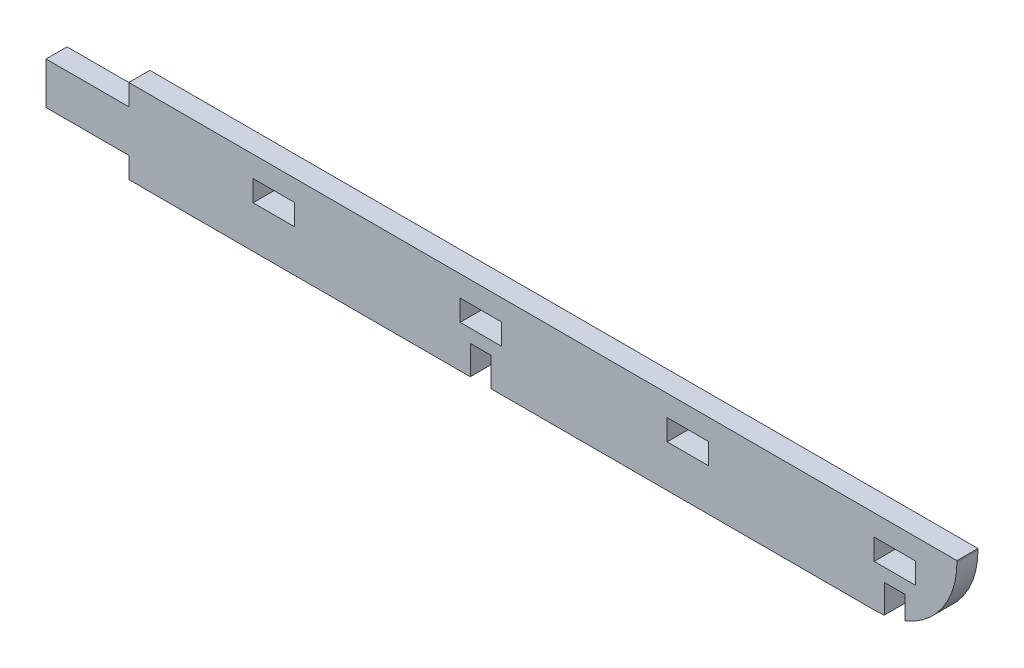
ISO-10303-21;
HEADER;
FILE_DESCRIPTION(('STEP AP214'),'2;1');
FILE_NAME('part.step','',(''),(''),'','','');
FILE_SCHEMA(('AUTOMOTIVE_DESIGN { 1 0 10303 214 1 1 1 1 }'));
ENDSEC;
DATA;
#1=APPLICATION_CONTEXT('core data for automotive mechanical design processes');
#2=APPLICATION_PROTOCOL_DEFINITION('international standard','automotive_design',2000,#1);
#3=PRODUCT_CONTEXT('',#1,'mechanical');
#4=PRODUCT('Part','Part','',(#3));
#5=PRODUCT_RELATED_PRODUCT_CATEGORY('part','',(#4));
#6=PRODUCT_DEFINITION_FORMATION('','',#4);
#7=PRODUCT_DEFINITION_CONTEXT('part definition',#1,'design');
#8=PRODUCT_DEFINITION('design','',#6,#7);
#9=PRODUCT_DEFINITION_SHAPE('','',#8);
#10=(LENGTH_UNIT() NAMED_UNIT(*) SI_UNIT(.MILLI.,.METRE.));
#11=(NAMED_UNIT(*) PLANE_ANGLE_UNIT() SI_UNIT($,.RADIAN.));
#12=(NAMED_UNIT(*) SI_UNIT($,.STERADIAN.) SOLID_ANGLE_UNIT());
#13=UNCERTAINTY_MEASURE_WITH_UNIT(LENGTH_MEASURE(1.E-05),#10,'distance_accuracy_value','');
#14=(GEOMETRIC_REPRESENTATION_CONTEXT(3) GLOBAL_UNCERTAINTY_ASSIGNED_CONTEXT((#13)) GLOBAL_UNIT_ASSIGNED_CONTEXT((#10,
#11,#12)) REPRESENTATION_CONTEXT('',''));
#15=CARTESIAN_POINT('',(0.,0.,0.));
#16=DIRECTION('',(0.,0.,1.));
#17=DIRECTION('',(1.,0.,0.));
#18=AXIS2_PLACEMENT_3D('',#15,#16,#17);
#19=CARTESIAN_POINT('',(80.,9.84,5.08));
#20=DIRECTION('',(0.,0.,-1.));
#21=DIRECTION('',(-1.,0.,0.));
#22=AXIS2_PLACEMENT_3D('',#19,#20,#21);
#23=CYLINDRICAL_SURFACE('',#22,20.);
#24=DIRECTION('',(0.,0.,-1.));
#25=VECTOR('',#24,1.);
#26=CARTESIAN_POINT('',(82.46,-10.0081334134976,5.08));
#27=LINE('',#26,#25);
#28=CARTESIAN_POINT('',(82.46,-10.0081334134976,5.08));
#29=VERTEX_POINT('',#28);
#30=CARTESIAN_POINT('',(82.46,-10.0081334134976,0.));
#31=VERTEX_POINT('',#30);
#32=EDGE_CURVE('E11',#29,#31,#27,.T.);
#33=ORIENTED_EDGE('',*,*,#32,.F.);
#34=CARTESIAN_POINT('',(80.,9.84,5.08));
#35=DIRECTION('',(0.,0.,-1.));
#36=DIRECTION('',(-1.,0.,0.));
#37=AXIS2_PLACEMENT_3D('',#34,#35,#36);
#38=CIRCLE('',#37,20.);
#39=CARTESIAN_POINT('',(80.,-10.16,5.08));
#40=VERTEX_POINT('',#39);
#41=EDGE_CURVE('E494',#40,#29,#38,.F.);
#42=ORIENTED_EDGE('',*,*,#41,.F.);
#43=DIRECTION('',(0.,0.,-1.));
#44=VECTOR('',#43,1.);
#45=CARTESIAN_POINT('',(80.,-10.16,5.08));
#46=LINE('',#45,#44);
#47=CARTESIAN_POINT('',(80.,-10.16,0.));
#48=VERTEX_POINT('',#47);
#49=EDGE_CURVE('E490',#48,#40,#46,.F.);
#50=ORIENTED_EDGE('',*,*,#49,.F.);
#51=CARTESIAN_POINT('',(80.,9.84,0.));
#52=DIRECTION('',(0.,0.,-1.));
#53=DIRECTION('',(-1.,0.,0.));
#54=AXIS2_PLACEMENT_3D('',#51,#52,#53);
#55=CIRCLE('',#54,20.);
#56=EDGE_CURVE('E486',#31,#48,#55,.T.);
#57=ORIENTED_EDGE('',*,*,#56,.F.);
#58=EDGE_LOOP('',(#33,#42,#50,#57));
#59=FACE_BOUND('',#58,.T.);
#60=ADVANCED_FACE('F33',(#59),#23,.T.);
#61=CARTESIAN_POINT('',(-100.,-10.16,5.08));
#62=DIRECTION('',(0.,1.,0.));
#63=DIRECTION('',(0.,0.,1.));
#64=AXIS2_PLACEMENT_3D('',#61,#62,#63);
#65=PLANE('',#64);
#66=DIRECTION('',(1.,0.,0.));
#67=VECTOR('',#66,1.);
#68=CARTESIAN_POINT('',(-100.,-10.16,0.));
#69=LINE('',#68,#67);
#70=CARTESIAN_POINT('',(-100.,-10.16,0.));
#71=VERTEX_POINT('',#70);
#72=CARTESIAN_POINT('',(-17.54,-10.16,0.));
#73=VERTEX_POINT('',#72);
#74=EDGE_CURVE('E430',#71,#73,#69,.T.);
#75=ORIENTED_EDGE('',*,*,#74,.T.);
#76=DIRECTION('',(0.,0.,1.));
#77=VECTOR('',#76,1.);
#78=CARTESIAN_POINT('',(-17.54,-10.16,0.));
#79=LINE('',#78,#77);
#80=CARTESIAN_POINT('',(-17.54,-10.16,5.08));
#81=VERTEX_POINT('',#80);
#82=EDGE_CURVE('E411',#73,#81,#79,.T.);
#83=ORIENTED_EDGE('',*,*,#82,.T.);
#84=DIRECTION('',(1.,0.,0.));
#85=VECTOR('',#84,1.);
#86=CARTESIAN_POINT('',(-100.,-10.16,5.08));
#87=LINE('',#86,#85);
#88=CARTESIAN_POINT('',(-100.,-10.16,5.08));
#89=VERTEX_POINT('',#88);
#90=EDGE_CURVE('E443',#89,#81,#87,.T.);
#91=ORIENTED_EDGE('',*,*,#90,.F.);
#92=DIRECTION('',(0.,0.,-1.));
#93=VECTOR('',#92,1.);
#94=CARTESIAN_POINT('',(-100.,-10.16,5.08));
#95=LINE('',#94,#93);
#96=EDGE_CURVE('E446',#89,#71,#95,.T.);
#97=ORIENTED_EDGE('',*,*,#96,.T.);
#98=EDGE_LOOP('',(#75,#83,#91,#97));
#99=FACE_BOUND('',#98,.T.);
#100=ADVANCED_FACE('F546',(#99),#65,.F.);
#101=CARTESIAN_POINT('',(100.,-10.16,5.08));
#102=DIRECTION('',(-1.,0.,0.));
#103=DIRECTION('',(0.,0.,1.));
#104=AXIS2_PLACEMENT_3D('',#101,#102,#103);
#105=PLANE('',#104);
#106=DIRECTION('',(0.,1.,0.));
#107=VECTOR('',#106,1.);
#108=CARTESIAN_POINT('',(100.,-10.16,5.08));
#109=LINE('',#108,#107);
#110=CARTESIAN_POINT('',(100.,9.84,5.08));
#111=VERTEX_POINT('',#110);
#112=CARTESIAN_POINT('',(100.,10.16,5.08));
#113=VERTEX_POINT('',#112);
#114=EDGE_CURVE('E427',#111,#113,#109,.T.);
#115=ORIENTED_EDGE('',*,*,#114,.F.);
#116=DIRECTION('',(0.,0.,-1.));
#117=VECTOR('',#116,1.);
#118=CARTESIAN_POINT('',(100.,9.84,5.08));
#119=LINE('',#118,#117);
#120=CARTESIAN_POINT('',(100.,9.84,0.));
#121=VERTEX_POINT('',#120);
#122=EDGE_CURVE('E483',#111,#121,#119,.T.);
#123=ORIENTED_EDGE('',*,*,#122,.T.);
#124=DIRECTION('',(0.,1.,0.));
#125=VECTOR('',#124,1.);
#126=CARTESIAN_POINT('',(100.,-10.16,0.));
#127=LINE('',#126,#125);
#128=CARTESIAN_POINT('',(100.,10.16,0.));
#129=VERTEX_POINT('',#128);
#130=EDGE_CURVE('E420',#121,#129,#127,.T.);
#131=ORIENTED_EDGE('',*,*,#130,.T.);
#132=DIRECTION('',(0.,0.,-1.));
#133=VECTOR('',#132,1.);
#134=CARTESIAN_POINT('',(100.,10.16,5.08));
#135=LINE('',#134,#133);
#136=EDGE_CURVE('E480',#113,#129,#135,.T.);
#137=ORIENTED_EDGE('',*,*,#136,.F.);
#138=EDGE_LOOP('',(#115,#123,#131,#137));
#139=FACE_BOUND('',#138,.T.);
#140=ADVANCED_FACE('F510',(#139),#105,.F.);
#141=CARTESIAN_POINT('',(-100.,10.16,5.08));
#142=DIRECTION('',(0.,-1.,0.));
#143=DIRECTION('',(0.,0.,-1.));
#144=AXIS2_PLACEMENT_3D('',#141,#142,#143);
#145=PLANE('',#144);
#146=DIRECTION('',(-1.,0.,0.));
#147=VECTOR('',#146,1.);
#148=CARTESIAN_POINT('',(-100.,10.16,0.));
#149=LINE('',#148,#147);
#150=CARTESIAN_POINT('',(-100.,10.16,0.));
#151=VERTEX_POINT('',#150);
#152=EDGE_CURVE('E448',#129,#151,#149,.T.);
#153=ORIENTED_EDGE('',*,*,#152,.T.);
#154=DIRECTION('',(0.,0.,-1.));
#155=VECTOR('',#154,1.);
#156=CARTESIAN_POINT('',(-100.,10.16,5.08));
#157=LINE('',#156,#155);
#158=CARTESIAN_POINT('',(-100.,10.16,5.08));
#159=VERTEX_POINT('',#158);
#160=EDGE_CURVE('E477',#159,#151,#157,.T.);
#161=ORIENTED_EDGE('',*,*,#160,.F.);
#162=DIRECTION('',(-1.,0.,0.));
#163=VECTOR('',#162,1.);
#164=CARTESIAN_POINT('',(-100.,10.16,5.08));
#165=LINE('',#164,#163);
#166=EDGE_CURVE('E429',#113,#159,#165,.T.);
#167=ORIENTED_EDGE('',*,*,#166,.F.);
#168=ORIENTED_EDGE('',*,*,#136,.T.);
#169=EDGE_LOOP('',(#153,#161,#167,#168));
#170=FACE_BOUND('',#169,.T.);
#171=ADVANCED_FACE('F519',(#170),#145,.F.);
#172=CARTESIAN_POINT('',(-100.,5.08,5.08));
#173=DIRECTION('',(1.,0.,0.));
#174=DIRECTION('',(0.,0.,-1.));
#175=AXIS2_PLACEMENT_3D('',#172,#173,#174);
#176=PLANE('',#175);
#177=DIRECTION('',(0.,-1.,0.));
#178=VECTOR('',#177,1.);
#179=CARTESIAN_POINT('',(-100.,5.08,0.));
#180=LINE('',#179,#178);
#181=CARTESIAN_POINT('',(-100.,5.08,0.));
#182=VERTEX_POINT('',#181);
#183=EDGE_CURVE('E450',#151,#182,#180,.T.);
#184=ORIENTED_EDGE('',*,*,#183,.T.);
#185=DIRECTION('',(0.,0.,-1.));
#186=VECTOR('',#185,1.);
#187=CARTESIAN_POINT('',(-100.,5.08,5.08));
#188=LINE('',#187,#186);
#189=CARTESIAN_POINT('',(-100.,5.08,5.08));
#190=VERTEX_POINT('',#189);
#191=EDGE_CURVE('E474',#190,#182,#188,.T.);
#192=ORIENTED_EDGE('',*,*,#191,.F.);
#193=DIRECTION('',(0.,-1.,0.));
#194=VECTOR('',#193,1.);
#195=CARTESIAN_POINT('',(-100.,5.08,5.08));
#196=LINE('',#195,#194);
#197=EDGE_CURVE('E432',#159,#190,#196,.T.);
#198=ORIENTED_EDGE('',*,*,#197,.F.);
#199=ORIENTED_EDGE('',*,*,#160,.T.);
#200=EDGE_LOOP('',(#184,#192,#198,#199));
#201=FACE_BOUND('',#200,.T.);
#202=ADVANCED_FACE('F525',(#201),#176,.F.);
#203=CARTESIAN_POINT('',(-100.,5.08,5.08));
#204=DIRECTION('',(0.,-1.,0.));
#205=DIRECTION('',(1.,0.,0.));
#206=AXIS2_PLACEMENT_3D('',#203,#204,#205);
#207=PLANE('',#206);
#208=DIRECTION('',(-1.,0.,0.));
#209=VECTOR('',#208,1.);
#210=CARTESIAN_POINT('',(-100.,5.08,0.));
#211=LINE('',#210,#209);
#212=CARTESIAN_POINT('',(-120.,5.08,0.));
#213=VERTEX_POINT('',#212);
#214=EDGE_CURVE('E452',#182,#213,#211,.T.);
#215=ORIENTED_EDGE('',*,*,#214,.T.);
#216=DIRECTION('',(0.,0.,-1.));
#217=VECTOR('',#216,1.);
#218=CARTESIAN_POINT('',(-120.,5.08,5.08));
#219=LINE('',#218,#217);
#220=CARTESIAN_POINT('',(-120.,5.08,5.08));
#221=VERTEX_POINT('',#220);
#222=EDGE_CURVE('E471',#221,#213,#219,.T.);
#223=ORIENTED_EDGE('',*,*,#222,.F.);
#224=DIRECTION('',(-1.,0.,0.));
#225=VECTOR('',#224,1.);
#226=CARTESIAN_POINT('',(-100.,5.08,5.08));
#227=LINE('',#226,#225);
#228=EDGE_CURVE('E434',#190,#221,#227,.T.);
#229=ORIENTED_EDGE('',*,*,#228,.F.);
#230=ORIENTED_EDGE('',*,*,#191,.T.);
#231=EDGE_LOOP('',(#215,#223,#229,#230));
#232=FACE_BOUND('',#231,.T.);
#233=ADVANCED_FACE('F527',(#232),#207,.F.);
#234=CARTESIAN_POINT('',(-120.,5.08,5.08));
#235=DIRECTION('',(1.,0.,0.));
#236=DIRECTION('',(0.,0.,-1.));
#237=AXIS2_PLACEMENT_3D('',#234,#235,#236);
#238=PLANE('',#237);
#239=DIRECTION('',(0.,-1.,0.));
#240=VECTOR('',#239,1.);
#241=CARTESIAN_POINT('',(-120.,5.08,0.));
#242=LINE('',#241,#240);
#243=CARTESIAN_POINT('',(-120.,-5.08,0.));
#244=VERTEX_POINT('',#243);
#245=EDGE_CURVE('E454',#213,#244,#242,.T.);
#246=ORIENTED_EDGE('',*,*,#245,.T.);
#247=DIRECTION('',(0.,0.,-1.));
#248=VECTOR('',#247,1.);
#249=CARTESIAN_POINT('',(-120.,-5.08,5.08));
#250=LINE('',#249,#248);
#251=CARTESIAN_POINT('',(-120.,-5.08,5.08));
#252=VERTEX_POINT('',#251);
#253=EDGE_CURVE('E468',#252,#244,#250,.T.);
#254=ORIENTED_EDGE('',*,*,#253,.F.);
#255=DIRECTION('',(0.,-1.,0.));
#256=VECTOR('',#255,1.);
#257=CARTESIAN_POINT('',(-120.,5.08,5.08));
#258=LINE('',#257,#256);
#259=EDGE_CURVE('E436',#221,#252,#258,.T.);
#260=ORIENTED_EDGE('',*,*,#259,.F.);
#261=ORIENTED_EDGE('',*,*,#222,.T.);
#262=EDGE_LOOP('',(#246,#254,#260,#261));
#263=FACE_BOUND('',#262,.T.);
#264=ADVANCED_FACE('F532',(#263),#238,.F.);
#265=CARTESIAN_POINT('',(-100.,-5.08,5.08));
#266=DIRECTION('',(0.,1.,0.));
#267=DIRECTION('',(-1.,0.,0.));
#268=AXIS2_PLACEMENT_3D('',#265,#266,#267);
#269=PLANE('',#268);
#270=DIRECTION('',(1.,0.,0.));
#271=VECTOR('',#270,1.);
#272=CARTESIAN_POINT('',(-100.,-5.08,0.));
#273=LINE('',#272,#271);
#274=CARTESIAN_POINT('',(-100.,-5.08,0.));
#275=VERTEX_POINT('',#274);
#276=EDGE_CURVE('E456',#244,#275,#273,.T.);
#277=ORIENTED_EDGE('',*,*,#276,.T.);
#278=DIRECTION('',(0.,0.,-1.));
#279=VECTOR('',#278,1.);
#280=CARTESIAN_POINT('',(-100.,-5.08,5.08));
#281=LINE('',#280,#279);
#282=CARTESIAN_POINT('',(-100.,-5.08,5.08));
#283=VERTEX_POINT('',#282);
#284=EDGE_CURVE('E465',#283,#275,#281,.T.);
#285=ORIENTED_EDGE('',*,*,#284,.F.);
#286=DIRECTION('',(1.,0.,0.));
#287=VECTOR('',#286,1.);
#288=CARTESIAN_POINT('',(-100.,-5.08,5.08));
#289=LINE('',#288,#287);
#290=EDGE_CURVE('E438',#252,#283,#289,.T.);
#291=ORIENTED_EDGE('',*,*,#290,.F.);
#292=ORIENTED_EDGE('',*,*,#253,.T.);
#293=EDGE_LOOP('',(#277,#285,#291,#292));
#294=FACE_BOUND('',#293,.T.);
#295=ADVANCED_FACE('F538',(#294),#269,.F.);
#296=CARTESIAN_POINT('',(-100.,-10.16,5.08));
#297=DIRECTION('',(1.,0.,0.));
#298=DIRECTION('',(0.,0.,-1.));
#299=AXIS2_PLACEMENT_3D('',#296,#297,#298);
#300=PLANE('',#299);
#301=DIRECTION('',(0.,-1.,0.));
#302=VECTOR('',#301,1.);
#303=CARTESIAN_POINT('',(-100.,-10.16,0.));
#304=LINE('',#303,#302);
#305=EDGE_CURVE('E458',#275,#71,#304,.T.);
#306=ORIENTED_EDGE('',*,*,#305,.T.);
#307=ORIENTED_EDGE('',*,*,#96,.F.);
#308=DIRECTION('',(0.,-1.,0.));
#309=VECTOR('',#308,1.);
#310=CARTESIAN_POINT('',(-100.,-10.16,5.08));
#311=LINE('',#310,#309);
#312=EDGE_CURVE('E440',#283,#89,#311,.T.);
#313=ORIENTED_EDGE('',*,*,#312,.F.);
#314=ORIENTED_EDGE('',*,*,#284,.T.);
#315=EDGE_LOOP('',(#306,#307,#313,#314));
#316=FACE_BOUND('',#315,.T.);
#317=ADVANCED_FACE('F542',(#316),#300,.F.);
#318=CARTESIAN_POINT('',(-12.54,-10.16,5.08));
#319=VERTEX_POINT('',#318);
#320=EDGE_CURVE('E442',#319,#40,#87,.T.);
#321=ORIENTED_EDGE('',*,*,#320,.F.);
#322=DIRECTION('',(0.,0.,1.));
#323=VECTOR('',#322,1.);
#324=CARTESIAN_POINT('',(-12.54,-10.16,0.));
#325=LINE('',#324,#323);
#326=CARTESIAN_POINT('',(-12.54,-10.16,0.));
#327=VERTEX_POINT('',#326);
#328=EDGE_CURVE('E423',#327,#319,#325,.T.);
#329=ORIENTED_EDGE('',*,*,#328,.F.);
#330=EDGE_CURVE('E460',#327,#48,#69,.T.);
#331=ORIENTED_EDGE('',*,*,#330,.T.);
#332=ORIENTED_EDGE('',*,*,#49,.T.);
#333=EDGE_LOOP('',(#321,#329,#331,#332));
#334=FACE_BOUND('',#333,.T.);
#335=ADVANCED_FACE('F561',(#334),#65,.F.);
#336=CARTESIAN_POINT('',(0.,0.,5.08));
#337=DIRECTION('',(0.,0.,-1.));
#338=DIRECTION('',(-1.,0.,0.));
#339=AXIS2_PLACEMENT_3D('',#336,#337,#338);
#340=PLANE('',#339);
#341=DIRECTION('',(1.,0.,0.));
#342=VECTOR('',#341,1.);
#343=CARTESIAN_POINT('',(80.,0.,5.08));
#344=LINE('',#343,#342);
#345=CARTESIAN_POINT('',(80.,0.,5.08));
#346=VERTEX_POINT('',#345);
#347=CARTESIAN_POINT('',(90.,0.,5.08));
#348=VERTEX_POINT('',#347);
#349=EDGE_CURVE('E274',#346,#348,#344,.T.);
#350=ORIENTED_EDGE('',*,*,#349,.F.);
#351=DIRECTION('',(0.,-1.,0.));
#352=VECTOR('',#351,1.);
#353=CARTESIAN_POINT('',(80.,5.08,5.08));
#354=LINE('',#353,#352);
#355=CARTESIAN_POINT('',(80.,5.08,5.08));
#356=VERTEX_POINT('',#355);
#357=EDGE_CURVE('E48',#356,#346,#354,.T.);
#358=ORIENTED_EDGE('',*,*,#357,.F.);
#359=DIRECTION('',(-1.,0.,0.));
#360=VECTOR('',#359,1.);
#361=CARTESIAN_POINT('',(80.,5.08,5.08));
#362=LINE('',#361,#360);
#363=CARTESIAN_POINT('',(90.,5.08,5.08));
#364=VERTEX_POINT('',#363);
#365=EDGE_CURVE('E265',#364,#356,#362,.T.);
#366=ORIENTED_EDGE('',*,*,#365,.F.);
#367=DIRECTION('',(0.,1.,0.));
#368=VECTOR('',#367,1.);
#369=CARTESIAN_POINT('',(90.,5.08,5.08));
#370=LINE('',#369,#368);
#371=EDGE_CURVE('E268',#348,#364,#370,.T.);
#372=ORIENTED_EDGE('',*,*,#371,.F.);
#373=EDGE_LOOP('',(#350,#358,#366,#372));
#374=FACE_BOUND('',#373,.T.);
#375=DIRECTION('',(1.,0.,0.));
#376=VECTOR('',#375,1.);
#377=CARTESIAN_POINT('',(30.,0.,5.08));
#378=LINE('',#377,#376);
#379=CARTESIAN_POINT('',(30.,0.,5.08));
#380=VERTEX_POINT('',#379);
#381=CARTESIAN_POINT('',(40.,0.,5.08));
#382=VERTEX_POINT('',#381);
#383=EDGE_CURVE('E299',#380,#382,#378,.T.);
#384=ORIENTED_EDGE('',*,*,#383,.F.);
#385=DIRECTION('',(0.,-1.,0.));
#386=VECTOR('',#385,1.);
#387=CARTESIAN_POINT('',(30.,5.08,5.08));
#388=LINE('',#387,#386);
#389=CARTESIAN_POINT('',(30.,5.08,5.08));
#390=VERTEX_POINT('',#389);
#391=EDGE_CURVE('E280',#390,#380,#388,.T.);
#392=ORIENTED_EDGE('',*,*,#391,.F.);
#393=DIRECTION('',(-1.,0.,0.));
#394=VECTOR('',#393,1.);
#395=CARTESIAN_POINT('',(30.,5.08,5.08));
#396=LINE('',#395,#394);
#397=CARTESIAN_POINT('',(40.,5.08,5.08));
#398=VERTEX_POINT('',#397);
#399=EDGE_CURVE('E288',#398,#390,#396,.T.);
#400=ORIENTED_EDGE('',*,*,#399,.F.);
#401=DIRECTION('',(0.,1.,0.));
#402=VECTOR('',#401,1.);
#403=CARTESIAN_POINT('',(40.,5.08,5.08));
#404=LINE('',#403,#402);
#405=EDGE_CURVE('E302',#382,#398,#404,.T.);
#406=ORIENTED_EDGE('',*,*,#405,.F.);
#407=EDGE_LOOP('',(#384,#392,#400,#406));
#408=FACE_BOUND('',#407,.T.);
#409=DIRECTION('',(1.,0.,0.));
#410=VECTOR('',#409,1.);
#411=CARTESIAN_POINT('',(-20.,0.,5.08));
#412=LINE('',#411,#410);
#413=CARTESIAN_POINT('',(-20.,0.,5.08));
#414=VERTEX_POINT('',#413);
#415=CARTESIAN_POINT('',(-10.,0.,5.08));
#416=VERTEX_POINT('',#415);
#417=EDGE_CURVE('E331',#414,#416,#412,.T.);
#418=ORIENTED_EDGE('',*,*,#417,.F.);
#419=DIRECTION('',(0.,-1.,0.));
#420=VECTOR('',#419,1.);
#421=CARTESIAN_POINT('',(-20.,5.08,5.08));
#422=LINE('',#421,#420);
#423=CARTESIAN_POINT('',(-20.,5.08,5.08));
#424=VERTEX_POINT('',#423);
#425=EDGE_CURVE('E309',#424,#414,#422,.T.);
#426=ORIENTED_EDGE('',*,*,#425,.F.);
#427=DIRECTION('',(-1.,0.,0.));
#428=VECTOR('',#427,1.);
#429=CARTESIAN_POINT('',(-20.,5.08,5.08));
#430=LINE('',#429,#428);
#431=CARTESIAN_POINT('',(-10.,5.08,5.08));
#432=VERTEX_POINT('',#431);
#433=EDGE_CURVE('E320',#432,#424,#430,.T.);
#434=ORIENTED_EDGE('',*,*,#433,.F.);
#435=DIRECTION('',(0.,1.,0.));
#436=VECTOR('',#435,1.);
#437=CARTESIAN_POINT('',(-10.,5.08,5.08));
#438=LINE('',#437,#436);
#439=EDGE_CURVE('E334',#416,#432,#438,.T.);
#440=ORIENTED_EDGE('',*,*,#439,.F.);
#441=EDGE_LOOP('',(#418,#426,#434,#440));
#442=FACE_BOUND('',#441,.T.);
#443=DIRECTION('',(1.,0.,0.));
#444=VECTOR('',#443,1.);
#445=CARTESIAN_POINT('',(-70.,0.,5.08));
#446=LINE('',#445,#444);
#447=CARTESIAN_POINT('',(-70.,0.,5.08));
#448=VERTEX_POINT('',#447);
#449=CARTESIAN_POINT('',(-60.,0.,5.08));
#450=VERTEX_POINT('',#449);
#451=EDGE_CURVE('E363',#448,#450,#446,.T.);
#452=ORIENTED_EDGE('',*,*,#451,.F.);
#453=DIRECTION('',(0.,-1.,0.));
#454=VECTOR('',#453,1.);
#455=CARTESIAN_POINT('',(-70.,5.08,5.08));
#456=LINE('',#455,#454);
#457=CARTESIAN_POINT('',(-70.,5.08,5.08));
#458=VERTEX_POINT('',#457);
#459=EDGE_CURVE('E341',#458,#448,#456,.T.);
#460=ORIENTED_EDGE('',*,*,#459,.F.);
#461=DIRECTION('',(-1.,0.,0.));
#462=VECTOR('',#461,1.);
#463=CARTESIAN_POINT('',(-70.,5.08,5.08));
#464=LINE('',#463,#462);
#465=CARTESIAN_POINT('',(-60.,5.08,5.08));
#466=VERTEX_POINT('',#465);
#467=EDGE_CURVE('E352',#466,#458,#464,.T.);
#468=ORIENTED_EDGE('',*,*,#467,.F.);
#469=DIRECTION('',(0.,1.,0.));
#470=VECTOR('',#469,1.);
#471=CARTESIAN_POINT('',(-60.,5.08,5.08));
#472=LINE('',#471,#470);
#473=EDGE_CURVE('E366',#450,#466,#472,.T.);
#474=ORIENTED_EDGE('',*,*,#473,.F.);
#475=EDGE_LOOP('',(#452,#460,#468,#474));
#476=FACE_BOUND('',#475,.T.);
#477=ORIENTED_EDGE('',*,*,#41,.T.);
#478=DIRECTION('',(0.,-1.,0.));
#479=VECTOR('',#478,1.);
#480=CARTESIAN_POINT('',(82.46,-10.16,5.08));
#481=LINE('',#480,#479);
#482=CARTESIAN_POINT('',(82.46,-3.16,5.08));
#483=VERTEX_POINT('',#482);
#484=EDGE_CURVE('E373',#483,#29,#481,.T.);
#485=ORIENTED_EDGE('',*,*,#484,.F.);
#486=DIRECTION('',(-1.,0.,0.));
#487=VECTOR('',#486,1.);
#488=CARTESIAN_POINT('',(82.46,-3.16,5.08));
#489=LINE('',#488,#487);
#490=CARTESIAN_POINT('',(87.46,-3.16,5.08));
#491=VERTEX_POINT('',#490);
#492=EDGE_CURVE('E384',#491,#483,#489,.T.);
#493=ORIENTED_EDGE('',*,*,#492,.F.);
#494=DIRECTION('',(0.,1.,0.));
#495=VECTOR('',#494,1.);
#496=CARTESIAN_POINT('',(87.46,-10.16,5.08));
#497=LINE('',#496,#495);
#498=CARTESIAN_POINT('',(87.46,-8.71662684864898,5.08));
#499=VERTEX_POINT('',#498);
#500=EDGE_CURVE('E392',#499,#491,#497,.T.);
#501=ORIENTED_EDGE('',*,*,#500,.F.);
#502=EDGE_CURVE('E493',#499,#111,#38,.F.);
#503=ORIENTED_EDGE('',*,*,#502,.T.);
#504=ORIENTED_EDGE('',*,*,#114,.T.);
#505=ORIENTED_EDGE('',*,*,#166,.T.);
#506=ORIENTED_EDGE('',*,*,#197,.T.);
#507=ORIENTED_EDGE('',*,*,#228,.T.);
#508=ORIENTED_EDGE('',*,*,#259,.T.);
#509=ORIENTED_EDGE('',*,*,#290,.T.);
#510=ORIENTED_EDGE('',*,*,#312,.T.);
#511=ORIENTED_EDGE('',*,*,#90,.T.);
#512=DIRECTION('',(0.,-1.,0.));
#513=VECTOR('',#512,1.);
#514=CARTESIAN_POINT('',(-17.54,-10.16,5.08));
#515=LINE('',#514,#513);
#516=CARTESIAN_POINT('',(-17.54,-3.16,5.08));
#517=VERTEX_POINT('',#516);
#518=EDGE_CURVE('E398',#517,#81,#515,.T.);
#519=ORIENTED_EDGE('',*,*,#518,.F.);
#520=DIRECTION('',(-1.,0.,0.));
#521=VECTOR('',#520,1.);
#522=CARTESIAN_POINT('',(-17.54,-3.16,5.08));
#523=LINE('',#522,#521);
#524=CARTESIAN_POINT('',(-12.54,-3.16,5.08));
#525=VERTEX_POINT('',#524);
#526=EDGE_CURVE('E405',#525,#517,#523,.T.);
#527=ORIENTED_EDGE('',*,*,#526,.F.);
#528=DIRECTION('',(0.,1.,0.));
#529=VECTOR('',#528,1.);
#530=CARTESIAN_POINT('',(-12.54,-10.16,5.08));
#531=LINE('',#530,#529);
#532=EDGE_CURVE('E413',#319,#525,#531,.T.);
#533=ORIENTED_EDGE('',*,*,#532,.F.);
#534=ORIENTED_EDGE('',*,*,#320,.T.);
#535=EDGE_LOOP('',(#477,#485,#493,#501,#503,#504,#505,#506,#507,#508,#509,#510,#511,#519,#527,
#533,#534));
#536=FACE_BOUND('',#535,.T.);
#537=ADVANCED_FACE('F504',(#374,#408,#442,#476,#536),#340,.F.);
#538=CARTESIAN_POINT('',(0.,0.,0.));
#539=DIRECTION('',(0.,0.,-1.));
#540=DIRECTION('',(-1.,0.,0.));
#541=AXIS2_PLACEMENT_3D('',#538,#539,#540);
#542=PLANE('',#541);
#543=DIRECTION('',(0.,-1.,0.));
#544=VECTOR('',#543,1.);
#545=CARTESIAN_POINT('',(80.,5.08,0.));
#546=LINE('',#545,#544);
#547=CARTESIAN_POINT('',(80.,5.08,0.));
#548=VERTEX_POINT('',#547);
#549=CARTESIAN_POINT('',(80.,0.,0.));
#550=VERTEX_POINT('',#549);
#551=EDGE_CURVE('E249',#548,#550,#546,.T.);
#552=ORIENTED_EDGE('',*,*,#551,.T.);
#553=DIRECTION('',(1.,0.,0.));
#554=VECTOR('',#553,1.);
#555=CARTESIAN_POINT('',(80.,0.,0.));
#556=LINE('',#555,#554);
#557=CARTESIAN_POINT('',(90.,0.,0.));
#558=VERTEX_POINT('',#557);
#559=EDGE_CURVE('E258',#550,#558,#556,.T.);
#560=ORIENTED_EDGE('',*,*,#559,.T.);
#561=DIRECTION('',(0.,1.,0.));
#562=VECTOR('',#561,1.);
#563=CARTESIAN_POINT('',(90.,5.08,0.));
#564=LINE('',#563,#562);
#565=CARTESIAN_POINT('',(90.,5.08,0.));
#566=VERTEX_POINT('',#565);
#567=EDGE_CURVE('E56',#558,#566,#564,.T.);
#568=ORIENTED_EDGE('',*,*,#567,.T.);
#569=DIRECTION('',(-1.,0.,0.));
#570=VECTOR('',#569,1.);
#571=CARTESIAN_POINT('',(80.,5.08,0.));
#572=LINE('',#571,#570);
#573=EDGE_CURVE('E255',#566,#548,#572,.T.);
#574=ORIENTED_EDGE('',*,*,#573,.T.);
#575=EDGE_LOOP('',(#552,#560,#568,#574));
#576=FACE_BOUND('',#575,.T.);
#577=DIRECTION('',(0.,-1.,0.));
#578=VECTOR('',#577,1.);
#579=CARTESIAN_POINT('',(30.,5.08,0.));
#580=LINE('',#579,#578);
#581=CARTESIAN_POINT('',(30.,5.08,0.));
#582=VERTEX_POINT('',#581);
#583=CARTESIAN_POINT('',(30.,0.,0.));
#584=VERTEX_POINT('',#583);
#585=EDGE_CURVE('E284',#582,#584,#580,.T.);
#586=ORIENTED_EDGE('',*,*,#585,.T.);
#587=DIRECTION('',(1.,0.,0.));
#588=VECTOR('',#587,1.);
#589=CARTESIAN_POINT('',(30.,0.,0.));
#590=LINE('',#589,#588);
#591=CARTESIAN_POINT('',(40.,0.,0.));
#592=VERTEX_POINT('',#591);
#593=EDGE_CURVE('E287',#584,#592,#590,.T.);
#594=ORIENTED_EDGE('',*,*,#593,.T.);
#595=DIRECTION('',(0.,1.,0.));
#596=VECTOR('',#595,1.);
#597=CARTESIAN_POINT('',(40.,5.08,0.));
#598=LINE('',#597,#596);
#599=CARTESIAN_POINT('',(40.,5.08,0.));
#600=VERTEX_POINT('',#599);
#601=EDGE_CURVE('E291',#592,#600,#598,.T.);
#602=ORIENTED_EDGE('',*,*,#601,.T.);
#603=DIRECTION('',(-1.,0.,0.));
#604=VECTOR('',#603,1.);
#605=CARTESIAN_POINT('',(30.,5.08,0.));
#606=LINE('',#605,#604);
#607=EDGE_CURVE('E294',#600,#582,#606,.T.);
#608=ORIENTED_EDGE('',*,*,#607,.T.);
#609=EDGE_LOOP('',(#586,#594,#602,#608));
#610=FACE_BOUND('',#609,.T.);
#611=DIRECTION('',(0.,-1.,0.));
#612=VECTOR('',#611,1.);
#613=CARTESIAN_POINT('',(-20.,5.08,0.));
#614=LINE('',#613,#612);
#615=CARTESIAN_POINT('',(-20.,5.08,0.));
#616=VERTEX_POINT('',#615);
#617=CARTESIAN_POINT('',(-20.,0.,0.));
#618=VERTEX_POINT('',#617);
#619=EDGE_CURVE('E316',#616,#618,#614,.T.);
#620=ORIENTED_EDGE('',*,*,#619,.T.);
#621=DIRECTION('',(1.,0.,0.));
#622=VECTOR('',#621,1.);
#623=CARTESIAN_POINT('',(-20.,0.,0.));
#624=LINE('',#623,#622);
#625=CARTESIAN_POINT('',(-10.,0.,0.));
#626=VERTEX_POINT('',#625);
#627=EDGE_CURVE('E319',#618,#626,#624,.T.);
#628=ORIENTED_EDGE('',*,*,#627,.T.);
#629=DIRECTION('',(0.,1.,0.));
#630=VECTOR('',#629,1.);
#631=CARTESIAN_POINT('',(-10.,5.08,0.));
#632=LINE('',#631,#630);
#633=CARTESIAN_POINT('',(-10.,5.08,0.));
#634=VERTEX_POINT('',#633);
#635=EDGE_CURVE('E323',#626,#634,#632,.T.);
#636=ORIENTED_EDGE('',*,*,#635,.T.);
#637=DIRECTION('',(-1.,0.,0.));
#638=VECTOR('',#637,1.);
#639=CARTESIAN_POINT('',(-20.,5.08,0.));
#640=LINE('',#639,#638);
#641=EDGE_CURVE('E326',#634,#616,#640,.T.);
#642=ORIENTED_EDGE('',*,*,#641,.T.);
#643=EDGE_LOOP('',(#620,#628,#636,#642));
#644=FACE_BOUND('',#643,.T.);
#645=DIRECTION('',(0.,-1.,0.));
#646=VECTOR('',#645,1.);
#647=CARTESIAN_POINT('',(-70.,5.08,0.));
#648=LINE('',#647,#646);
#649=CARTESIAN_POINT('',(-70.,5.08,0.));
#650=VERTEX_POINT('',#649);
#651=CARTESIAN_POINT('',(-70.,0.,0.));
#652=VERTEX_POINT('',#651);
#653=EDGE_CURVE('E348',#650,#652,#648,.T.);
#654=ORIENTED_EDGE('',*,*,#653,.T.);
#655=DIRECTION('',(1.,0.,0.));
#656=VECTOR('',#655,1.);
#657=CARTESIAN_POINT('',(-70.,0.,0.));
#658=LINE('',#657,#656);
#659=CARTESIAN_POINT('',(-60.,0.,0.));
#660=VERTEX_POINT('',#659);
#661=EDGE_CURVE('E351',#652,#660,#658,.T.);
#662=ORIENTED_EDGE('',*,*,#661,.T.);
#663=DIRECTION('',(0.,1.,0.));
#664=VECTOR('',#663,1.);
#665=CARTESIAN_POINT('',(-60.,5.08,0.));
#666=LINE('',#665,#664);
#667=CARTESIAN_POINT('',(-60.,5.08,0.));
#668=VERTEX_POINT('',#667);
#669=EDGE_CURVE('E355',#660,#668,#666,.T.);
#670=ORIENTED_EDGE('',*,*,#669,.T.);
#671=DIRECTION('',(-1.,0.,0.));
#672=VECTOR('',#671,1.);
#673=CARTESIAN_POINT('',(-70.,5.08,0.));
#674=LINE('',#673,#672);
#675=EDGE_CURVE('E358',#668,#650,#674,.T.);
#676=ORIENTED_EDGE('',*,*,#675,.T.);
#677=EDGE_LOOP('',(#654,#662,#670,#676));
#678=FACE_BOUND('',#677,.T.);
#679=DIRECTION('',(0.,-1.,0.));
#680=VECTOR('',#679,1.);
#681=CARTESIAN_POINT('',(82.46,-10.16,0.));
#682=LINE('',#681,#680);
#683=CARTESIAN_POINT('',(82.46,-3.16,0.));
#684=VERTEX_POINT('',#683);
#685=EDGE_CURVE('E380',#684,#31,#682,.T.);
#686=ORIENTED_EDGE('',*,*,#685,.T.);
#687=ORIENTED_EDGE('',*,*,#56,.T.);
#688=ORIENTED_EDGE('',*,*,#330,.F.);
#689=DIRECTION('',(0.,1.,0.));
#690=VECTOR('',#689,1.);
#691=CARTESIAN_POINT('',(-12.54,-10.16,0.));
#692=LINE('',#691,#690);
#693=CARTESIAN_POINT('',(-12.54,-3.16,0.));
#694=VERTEX_POINT('',#693);
#695=EDGE_CURVE('E404',#327,#694,#692,.T.);
#696=ORIENTED_EDGE('',*,*,#695,.T.);
#697=DIRECTION('',(-1.,0.,0.));
#698=VECTOR('',#697,1.);
#699=CARTESIAN_POINT('',(-17.54,-3.16,0.));
#700=LINE('',#699,#698);
#701=CARTESIAN_POINT('',(-17.54,-3.16,0.));
#702=VERTEX_POINT('',#701);
#703=EDGE_CURVE('E408',#694,#702,#700,.T.);
#704=ORIENTED_EDGE('',*,*,#703,.T.);
#705=DIRECTION('',(0.,-1.,0.));
#706=VECTOR('',#705,1.);
#707=CARTESIAN_POINT('',(-17.54,-10.16,0.));
#708=LINE('',#707,#706);
#709=EDGE_CURVE('E401',#702,#73,#708,.T.);
#710=ORIENTED_EDGE('',*,*,#709,.T.);
#711=ORIENTED_EDGE('',*,*,#74,.F.);
#712=ORIENTED_EDGE('',*,*,#305,.F.);
#713=ORIENTED_EDGE('',*,*,#276,.F.);
#714=ORIENTED_EDGE('',*,*,#245,.F.);
#715=ORIENTED_EDGE('',*,*,#214,.F.);
#716=ORIENTED_EDGE('',*,*,#183,.F.);
#717=ORIENTED_EDGE('',*,*,#152,.F.);
#718=ORIENTED_EDGE('',*,*,#130,.F.);
#719=CARTESIAN_POINT('',(87.46,-8.71662684864898,0.));
#720=VERTEX_POINT('',#719);
#721=EDGE_CURVE('E487',#121,#720,#55,.T.);
#722=ORIENTED_EDGE('',*,*,#721,.T.);
#723=DIRECTION('',(0.,1.,0.));
#724=VECTOR('',#723,1.);
#725=CARTESIAN_POINT('',(87.46,-10.16,0.));
#726=LINE('',#725,#724);
#727=CARTESIAN_POINT('',(87.46,-3.16,0.));
#728=VERTEX_POINT('',#727);
#729=EDGE_CURVE('E383',#720,#728,#726,.T.);
#730=ORIENTED_EDGE('',*,*,#729,.T.);
#731=DIRECTION('',(-1.,0.,0.));
#732=VECTOR('',#731,1.);
#733=CARTESIAN_POINT('',(82.46,-3.16,0.));
#734=LINE('',#733,#732);
#735=EDGE_CURVE('E387',#728,#684,#734,.T.);
#736=ORIENTED_EDGE('',*,*,#735,.T.);
#737=EDGE_LOOP('',(#686,#687,#688,#696,#704,#710,#711,#712,#713,#714,#715,#716,#717,#718,#722,
#730,#736));
#738=FACE_BOUND('',#737,.T.);
#739=ADVANCED_FACE('F262',(#576,#610,#644,#678,#738),#542,.T.);
#740=DIRECTION('',(0.,0.,-1.));
#741=VECTOR('',#740,1.);
#742=CARTESIAN_POINT('',(87.46,-8.71662684864898,5.08));
#743=LINE('',#742,#741);
#744=EDGE_CURVE('E41',#720,#499,#743,.F.);
#745=ORIENTED_EDGE('',*,*,#744,.F.);
#746=ORIENTED_EDGE('',*,*,#721,.F.);
#747=ORIENTED_EDGE('',*,*,#122,.F.);
#748=ORIENTED_EDGE('',*,*,#502,.F.);
#749=EDGE_LOOP('',(#745,#746,#747,#748));
#750=FACE_BOUND('',#749,.T.);
#751=ADVANCED_FACE('F35',(#750),#23,.T.);
#752=CARTESIAN_POINT('',(-17.54,-10.16,0.));
#753=DIRECTION('',(-1.,0.,0.));
#754=DIRECTION('',(0.,0.,1.));
#755=AXIS2_PLACEMENT_3D('',#752,#753,#754);
#756=PLANE('',#755);
#757=ORIENTED_EDGE('',*,*,#518,.T.);
#758=ORIENTED_EDGE('',*,*,#82,.F.);
#759=ORIENTED_EDGE('',*,*,#709,.F.);
#760=DIRECTION('',(0.,0.,1.));
#761=VECTOR('',#760,1.);
#762=CARTESIAN_POINT('',(-17.54,-3.16,0.));
#763=LINE('',#762,#761);
#764=EDGE_CURVE('E418',#702,#517,#763,.T.);
#765=ORIENTED_EDGE('',*,*,#764,.T.);
#766=EDGE_LOOP('',(#757,#758,#759,#765));
#767=FACE_BOUND('',#766,.T.);
#768=ADVANCED_FACE('F551',(#767),#756,.F.);
#769=CARTESIAN_POINT('',(-17.54,-3.16,0.));
#770=DIRECTION('',(0.,1.,0.));
#771=DIRECTION('',(0.,0.,1.));
#772=AXIS2_PLACEMENT_3D('',#769,#770,#771);
#773=PLANE('',#772);
#774=ORIENTED_EDGE('',*,*,#526,.T.);
#775=ORIENTED_EDGE('',*,*,#764,.F.);
#776=ORIENTED_EDGE('',*,*,#703,.F.);
#777=DIRECTION('',(0.,0.,1.));
#778=VECTOR('',#777,1.);
#779=CARTESIAN_POINT('',(-12.54,-3.16,0.));
#780=LINE('',#779,#778);
#781=EDGE_CURVE('E421',#694,#525,#780,.T.);
#782=ORIENTED_EDGE('',*,*,#781,.T.);
#783=EDGE_LOOP('',(#774,#775,#776,#782));
#784=FACE_BOUND('',#783,.T.);
#785=ADVANCED_FACE('F554',(#784),#773,.F.);
#786=CARTESIAN_POINT('',(-12.54,-10.16,0.));
#787=DIRECTION('',(1.,0.,0.));
#788=DIRECTION('',(0.,0.,-1.));
#789=AXIS2_PLACEMENT_3D('',#786,#787,#788);
#790=PLANE('',#789);
#791=ORIENTED_EDGE('',*,*,#532,.T.);
#792=ORIENTED_EDGE('',*,*,#781,.F.);
#793=ORIENTED_EDGE('',*,*,#695,.F.);
#794=ORIENTED_EDGE('',*,*,#328,.T.);
#795=EDGE_LOOP('',(#791,#792,#793,#794));
#796=FACE_BOUND('',#795,.T.);
#797=ADVANCED_FACE('F557',(#796),#790,.F.);
#798=CARTESIAN_POINT('',(82.46,-10.16,0.));
#799=DIRECTION('',(-1.,0.,0.));
#800=DIRECTION('',(0.,-1.,0.));
#801=AXIS2_PLACEMENT_3D('',#798,#799,#800);
#802=PLANE('',#801);
#803=ORIENTED_EDGE('',*,*,#32,.T.);
#804=ORIENTED_EDGE('',*,*,#685,.F.);
#805=DIRECTION('',(0.,0.,1.));
#806=VECTOR('',#805,1.);
#807=CARTESIAN_POINT('',(82.46,-3.16,0.));
#808=LINE('',#807,#806);
#809=EDGE_CURVE('E396',#684,#483,#808,.T.);
#810=ORIENTED_EDGE('',*,*,#809,.T.);
#811=ORIENTED_EDGE('',*,*,#484,.T.);
#812=EDGE_LOOP('',(#803,#804,#810,#811));
#813=FACE_BOUND('',#812,.T.);
#814=ADVANCED_FACE('F570',(#813),#802,.F.);
#815=CARTESIAN_POINT('',(82.46,-3.16,0.));
#816=DIRECTION('',(0.,1.,0.));
#817=DIRECTION('',(0.,0.,1.));
#818=AXIS2_PLACEMENT_3D('',#815,#816,#817);
#819=PLANE('',#818);
#820=ORIENTED_EDGE('',*,*,#492,.T.);
#821=ORIENTED_EDGE('',*,*,#809,.F.);
#822=ORIENTED_EDGE('',*,*,#735,.F.);
#823=DIRECTION('',(0.,0.,1.));
#824=VECTOR('',#823,1.);
#825=CARTESIAN_POINT('',(87.46,-3.16,0.));
#826=LINE('',#825,#824);
#827=EDGE_CURVE('E390',#728,#491,#826,.T.);
#828=ORIENTED_EDGE('',*,*,#827,.T.);
#829=EDGE_LOOP('',(#820,#821,#822,#828));
#830=FACE_BOUND('',#829,.T.);
#831=ADVANCED_FACE('F574',(#830),#819,.F.);
#832=CARTESIAN_POINT('',(87.46,-10.16,0.));
#833=DIRECTION('',(1.,0.,0.));
#834=DIRECTION('',(0.,0.,-1.));
#835=AXIS2_PLACEMENT_3D('',#832,#833,#834);
#836=PLANE('',#835);
#837=ORIENTED_EDGE('',*,*,#744,.T.);
#838=ORIENTED_EDGE('',*,*,#500,.T.);
#839=ORIENTED_EDGE('',*,*,#827,.F.);
#840=ORIENTED_EDGE('',*,*,#729,.F.);
#841=EDGE_LOOP('',(#837,#838,#839,#840));
#842=FACE_BOUND('',#841,.T.);
#843=ADVANCED_FACE('F499',(#842),#836,.F.);
#844=CARTESIAN_POINT('',(-70.,5.08,0.));
#845=DIRECTION('',(-1.,0.,0.));
#846=DIRECTION('',(0.,0.,1.));
#847=AXIS2_PLACEMENT_3D('',#844,#845,#846);
#848=PLANE('',#847);
#849=ORIENTED_EDGE('',*,*,#459,.T.);
#850=DIRECTION('',(0.,0.,1.));
#851=VECTOR('',#850,1.);
#852=CARTESIAN_POINT('',(-70.,0.,0.));
#853=LINE('',#852,#851);
#854=EDGE_CURVE('E361',#652,#448,#853,.T.);
#855=ORIENTED_EDGE('',*,*,#854,.F.);
#856=ORIENTED_EDGE('',*,*,#653,.F.);
#857=DIRECTION('',(0.,0.,1.));
#858=VECTOR('',#857,1.);
#859=CARTESIAN_POINT('',(-70.,5.08,0.));
#860=LINE('',#859,#858);
#861=EDGE_CURVE('E371',#650,#458,#860,.T.);
#862=ORIENTED_EDGE('',*,*,#861,.T.);
#863=EDGE_LOOP('',(#849,#855,#856,#862));
#864=FACE_BOUND('',#863,.T.);
#865=ADVANCED_FACE('F581',(#864),#848,.F.);
#866=CARTESIAN_POINT('',(-70.,5.08,0.));
#867=DIRECTION('',(0.,1.,0.));
#868=DIRECTION('',(-1.,0.,0.));
#869=AXIS2_PLACEMENT_3D('',#866,#867,#868);
#870=PLANE('',#869);
#871=ORIENTED_EDGE('',*,*,#467,.T.);
#872=ORIENTED_EDGE('',*,*,#861,.F.);
#873=ORIENTED_EDGE('',*,*,#675,.F.);
#874=DIRECTION('',(0.,0.,1.));
#875=VECTOR('',#874,1.);
#876=CARTESIAN_POINT('',(-60.,5.08,0.));
#877=LINE('',#876,#875);
#878=EDGE_CURVE('E374',#668,#466,#877,.T.);
#879=ORIENTED_EDGE('',*,*,#878,.T.);
#880=EDGE_LOOP('',(#871,#872,#873,#879));
#881=FACE_BOUND('',#880,.T.);
#882=ADVANCED_FACE('F709',(#881),#870,.F.);
#883=CARTESIAN_POINT('',(-60.,5.08,0.));
#884=DIRECTION('',(1.,0.,0.));
#885=DIRECTION('',(0.,0.,-1.));
#886=AXIS2_PLACEMENT_3D('',#883,#884,#885);
#887=PLANE('',#886);
#888=ORIENTED_EDGE('',*,*,#473,.T.);
#889=ORIENTED_EDGE('',*,*,#878,.F.);
#890=ORIENTED_EDGE('',*,*,#669,.F.);
#891=DIRECTION('',(0.,0.,1.));
#892=VECTOR('',#891,1.);
#893=CARTESIAN_POINT('',(-60.,0.,0.));
#894=LINE('',#893,#892);
#895=EDGE_CURVE('E376',#660,#450,#894,.T.);
#896=ORIENTED_EDGE('',*,*,#895,.T.);
#897=EDGE_LOOP('',(#888,#889,#890,#896));
#898=FACE_BOUND('',#897,.T.);
#899=ADVANCED_FACE('F718',(#898),#887,.F.);
#900=CARTESIAN_POINT('',(-70.,0.,0.));
#901=DIRECTION('',(0.,-1.,0.));
#902=DIRECTION('',(0.,0.,-1.));
#903=AXIS2_PLACEMENT_3D('',#900,#901,#902);
#904=PLANE('',#903);
#905=ORIENTED_EDGE('',*,*,#451,.T.);
#906=ORIENTED_EDGE('',*,*,#895,.F.);
#907=ORIENTED_EDGE('',*,*,#661,.F.);
#908=ORIENTED_EDGE('',*,*,#854,.T.);
#909=EDGE_LOOP('',(#905,#906,#907,#908));
#910=FACE_BOUND('',#909,.T.);
#911=ADVANCED_FACE('F728',(#910),#904,.F.);
#912=CARTESIAN_POINT('',(-20.,5.08,0.));
#913=DIRECTION('',(-1.,0.,0.));
#914=DIRECTION('',(0.,0.,1.));
#915=AXIS2_PLACEMENT_3D('',#912,#913,#914);
#916=PLANE('',#915);
#917=ORIENTED_EDGE('',*,*,#425,.T.);
#918=DIRECTION('',(0.,0.,1.));
#919=VECTOR('',#918,1.);
#920=CARTESIAN_POINT('',(-20.,0.,0.));
#921=LINE('',#920,#919);
#922=EDGE_CURVE('E329',#618,#414,#921,.T.);
#923=ORIENTED_EDGE('',*,*,#922,.F.);
#924=ORIENTED_EDGE('',*,*,#619,.F.);
#925=DIRECTION('',(0.,0.,1.));
#926=VECTOR('',#925,1.);
#927=CARTESIAN_POINT('',(-20.,5.08,0.));
#928=LINE('',#927,#926);
#929=EDGE_CURVE('E339',#616,#424,#928,.T.);
#930=ORIENTED_EDGE('',*,*,#929,.T.);
#931=EDGE_LOOP('',(#917,#923,#924,#930));
#932=FACE_BOUND('',#931,.T.);
#933=ADVANCED_FACE('F738',(#932),#916,.F.);
#934=CARTESIAN_POINT('',(-20.,5.08,0.));
#935=DIRECTION('',(0.,1.,0.));
#936=DIRECTION('',(-1.,0.,0.));
#937=AXIS2_PLACEMENT_3D('',#934,#935,#936);
#938=PLANE('',#937);
#939=ORIENTED_EDGE('',*,*,#433,.T.);
#940=ORIENTED_EDGE('',*,*,#929,.F.);
#941=ORIENTED_EDGE('',*,*,#641,.F.);
#942=DIRECTION('',(0.,0.,1.));
#943=VECTOR('',#942,1.);
#944=CARTESIAN_POINT('',(-10.,5.08,0.));
#945=LINE('',#944,#943);
#946=EDGE_CURVE('E342',#634,#432,#945,.T.);
#947=ORIENTED_EDGE('',*,*,#946,.T.);
#948=EDGE_LOOP('',(#939,#940,#941,#947));
#949=FACE_BOUND('',#948,.T.);
#950=ADVANCED_FACE('F748',(#949),#938,.F.);
#951=CARTESIAN_POINT('',(-10.,5.08,0.));
#952=DIRECTION('',(1.,0.,0.));
#953=DIRECTION('',(0.,0.,-1.));
#954=AXIS2_PLACEMENT_3D('',#951,#952,#953);
#955=PLANE('',#954);
#956=ORIENTED_EDGE('',*,*,#439,.T.);
#957=ORIENTED_EDGE('',*,*,#946,.F.);
#958=ORIENTED_EDGE('',*,*,#635,.F.);
#959=DIRECTION('',(0.,0.,1.));
#960=VECTOR('',#959,1.);
#961=CARTESIAN_POINT('',(-10.,0.,0.));
#962=LINE('',#961,#960);
#963=EDGE_CURVE('E344',#626,#416,#962,.T.);
#964=ORIENTED_EDGE('',*,*,#963,.T.);
#965=EDGE_LOOP('',(#956,#957,#958,#964));
#966=FACE_BOUND('',#965,.T.);
#967=ADVANCED_FACE('F758',(#966),#955,.F.);
#968=CARTESIAN_POINT('',(-20.,0.,0.));
#969=DIRECTION('',(0.,-1.,0.));
#970=DIRECTION('',(0.,0.,-1.));
#971=AXIS2_PLACEMENT_3D('',#968,#969,#970);
#972=PLANE('',#971);
#973=ORIENTED_EDGE('',*,*,#417,.T.);
#974=ORIENTED_EDGE('',*,*,#963,.F.);
#975=ORIENTED_EDGE('',*,*,#627,.F.);
#976=ORIENTED_EDGE('',*,*,#922,.T.);
#977=EDGE_LOOP('',(#973,#974,#975,#976));
#978=FACE_BOUND('',#977,.T.);
#979=ADVANCED_FACE('F768',(#978),#972,.F.);
#980=CARTESIAN_POINT('',(30.,5.08,0.));
#981=DIRECTION('',(-1.,0.,0.));
#982=DIRECTION('',(0.,0.,1.));
#983=AXIS2_PLACEMENT_3D('',#980,#981,#982);
#984=PLANE('',#983);
#985=ORIENTED_EDGE('',*,*,#391,.T.);
#986=DIRECTION('',(0.,0.,1.));
#987=VECTOR('',#986,1.);
#988=CARTESIAN_POINT('',(30.,0.,0.));
#989=LINE('',#988,#987);
#990=EDGE_CURVE('E297',#584,#380,#989,.T.);
#991=ORIENTED_EDGE('',*,*,#990,.F.);
#992=ORIENTED_EDGE('',*,*,#585,.F.);
#993=DIRECTION('',(0.,0.,1.));
#994=VECTOR('',#993,1.);
#995=CARTESIAN_POINT('',(30.,5.08,0.));
#996=LINE('',#995,#994);
#997=EDGE_CURVE('E307',#582,#390,#996,.T.);
#998=ORIENTED_EDGE('',*,*,#997,.T.);
#999=EDGE_LOOP('',(#985,#991,#992,#998));
#1000=FACE_BOUND('',#999,.T.);
#1001=ADVANCED_FACE('F778',(#1000),#984,.F.);
#1002=CARTESIAN_POINT('',(30.,5.08,0.));
#1003=DIRECTION('',(0.,1.,0.));
#1004=DIRECTION('',(-1.,0.,0.));
#1005=AXIS2_PLACEMENT_3D('',#1002,#1003,#1004);
#1006=PLANE('',#1005);
#1007=ORIENTED_EDGE('',*,*,#399,.T.);
#1008=ORIENTED_EDGE('',*,*,#997,.F.);
#1009=ORIENTED_EDGE('',*,*,#607,.F.);
#1010=DIRECTION('',(0.,0.,1.));
#1011=VECTOR('',#1010,1.);
#1012=CARTESIAN_POINT('',(40.,5.08,0.));
#1013=LINE('',#1012,#1011);
#1014=EDGE_CURVE('E310',#600,#398,#1013,.T.);
#1015=ORIENTED_EDGE('',*,*,#1014,.T.);
#1016=EDGE_LOOP('',(#1007,#1008,#1009,#1015));
#1017=FACE_BOUND('',#1016,.T.);
#1018=ADVANCED_FACE('F788',(#1017),#1006,.F.);
#1019=CARTESIAN_POINT('',(40.,5.08,0.));
#1020=DIRECTION('',(1.,0.,0.));
#1021=DIRECTION('',(0.,0.,-1.));
#1022=AXIS2_PLACEMENT_3D('',#1019,#1020,#1021);
#1023=PLANE('',#1022);
#1024=ORIENTED_EDGE('',*,*,#405,.T.);
#1025=ORIENTED_EDGE('',*,*,#1014,.F.);
#1026=ORIENTED_EDGE('',*,*,#601,.F.);
#1027=DIRECTION('',(0.,0.,1.));
#1028=VECTOR('',#1027,1.);
#1029=CARTESIAN_POINT('',(40.,0.,0.));
#1030=LINE('',#1029,#1028);
#1031=EDGE_CURVE('E312',#592,#382,#1030,.T.);
#1032=ORIENTED_EDGE('',*,*,#1031,.T.);
#1033=EDGE_LOOP('',(#1024,#1025,#1026,#1032));
#1034=FACE_BOUND('',#1033,.T.);
#1035=ADVANCED_FACE('F798',(#1034),#1023,.F.);
#1036=CARTESIAN_POINT('',(30.,0.,0.));
#1037=DIRECTION('',(0.,-1.,0.));
#1038=DIRECTION('',(0.,0.,-1.));
#1039=AXIS2_PLACEMENT_3D('',#1036,#1037,#1038);
#1040=PLANE('',#1039);
#1041=ORIENTED_EDGE('',*,*,#383,.T.);
#1042=ORIENTED_EDGE('',*,*,#1031,.F.);
#1043=ORIENTED_EDGE('',*,*,#593,.F.);
#1044=ORIENTED_EDGE('',*,*,#990,.T.);
#1045=EDGE_LOOP('',(#1041,#1042,#1043,#1044));
#1046=FACE_BOUND('',#1045,.T.);
#1047=ADVANCED_FACE('F808',(#1046),#1040,.F.);
#1048=CARTESIAN_POINT('',(80.,5.08,0.));
#1049=DIRECTION('',(-1.,0.,0.));
#1050=DIRECTION('',(0.,0.,1.));
#1051=AXIS2_PLACEMENT_3D('',#1048,#1049,#1050);
#1052=PLANE('',#1051);
#1053=ORIENTED_EDGE('',*,*,#357,.T.);
#1054=DIRECTION('',(0.,0.,1.));
#1055=VECTOR('',#1054,1.);
#1056=CARTESIAN_POINT('',(80.,0.,0.));
#1057=LINE('',#1056,#1055);
#1058=EDGE_CURVE('E245',#550,#346,#1057,.T.);
#1059=ORIENTED_EDGE('',*,*,#1058,.F.);
#1060=ORIENTED_EDGE('',*,*,#551,.F.);
#1061=DIRECTION('',(0.,0.,1.));
#1062=VECTOR('',#1061,1.);
#1063=CARTESIAN_POINT('',(80.,5.08,0.));
#1064=LINE('',#1063,#1062);
#1065=EDGE_CURVE('E278',#548,#356,#1064,.T.);
#1066=ORIENTED_EDGE('',*,*,#1065,.T.);
#1067=EDGE_LOOP('',(#1053,#1059,#1060,#1066));
#1068=FACE_BOUND('',#1067,.T.);
#1069=ADVANCED_FACE('F247',(#1068),#1052,.F.);
#1070=CARTESIAN_POINT('',(80.,5.08,0.));
#1071=DIRECTION('',(0.,1.,0.));
#1072=DIRECTION('',(-1.,0.,0.));
#1073=AXIS2_PLACEMENT_3D('',#1070,#1071,#1072);
#1074=PLANE('',#1073);
#1075=ORIENTED_EDGE('',*,*,#365,.T.);
#1076=ORIENTED_EDGE('',*,*,#1065,.F.);
#1077=ORIENTED_EDGE('',*,*,#573,.F.);
#1078=DIRECTION('',(0.,0.,1.));
#1079=VECTOR('',#1078,1.);
#1080=CARTESIAN_POINT('',(90.,5.08,0.));
#1081=LINE('',#1080,#1079);
#1082=EDGE_CURVE('E281',#566,#364,#1081,.T.);
#1083=ORIENTED_EDGE('',*,*,#1082,.T.);
#1084=EDGE_LOOP('',(#1075,#1076,#1077,#1083));
#1085=FACE_BOUND('',#1084,.T.);
#1086=ADVANCED_FACE('F827',(#1085),#1074,.F.);
#1087=CARTESIAN_POINT('',(90.,5.08,0.));
#1088=DIRECTION('',(1.,0.,0.));
#1089=DIRECTION('',(0.,0.,-1.));
#1090=AXIS2_PLACEMENT_3D('',#1087,#1088,#1089);
#1091=PLANE('',#1090);
#1092=ORIENTED_EDGE('',*,*,#371,.T.);
#1093=ORIENTED_EDGE('',*,*,#1082,.F.);
#1094=ORIENTED_EDGE('',*,*,#567,.F.);
#1095=DIRECTION('',(0.,0.,1.));
#1096=VECTOR('',#1095,1.);
#1097=CARTESIAN_POINT('',(90.,0.,0.));
#1098=LINE('',#1097,#1096);
#1099=EDGE_CURVE('E254',#558,#348,#1098,.T.);
#1100=ORIENTED_EDGE('',*,*,#1099,.T.);
#1101=EDGE_LOOP('',(#1092,#1093,#1094,#1100));
#1102=FACE_BOUND('',#1101,.T.);
#1103=ADVANCED_FACE('F836',(#1102),#1091,.F.);
#1104=CARTESIAN_POINT('',(80.,0.,0.));
#1105=DIRECTION('',(0.,-1.,0.));
#1106=DIRECTION('',(0.,0.,-1.));
#1107=AXIS2_PLACEMENT_3D('',#1104,#1105,#1106);
#1108=PLANE('',#1107);
#1109=ORIENTED_EDGE('',*,*,#349,.T.);
#1110=ORIENTED_EDGE('',*,*,#1099,.F.);
#1111=ORIENTED_EDGE('',*,*,#559,.F.);
#1112=ORIENTED_EDGE('',*,*,#1058,.T.);
#1113=EDGE_LOOP('',(#1109,#1110,#1111,#1112));
#1114=FACE_BOUND('',#1113,.T.);
#1115=ADVANCED_FACE('F259',(#1114),#1108,.F.);
#1116=CLOSED_SHELL('',(#60,#100,#140,#171,#202,#233,#264,#295,#317,#335,#537,#739,#751,#768,
#785,#797,#814,#831,#843,#865,#882,#899,#911,#933,#950,#967,#979,#1001,#1018,#1035,#1047,#1069,
#1086,#1103,#1115));
#1117=MANIFOLD_SOLID_BREP('B2',#1116);
#1118=ADVANCED_BREP_SHAPE_REPRESENTATION('',(#18,#1117),#14);
#1119=SHAPE_DEFINITION_REPRESENTATION(#9,#1118);
ENDSEC;
END-ISO-10303-21;
